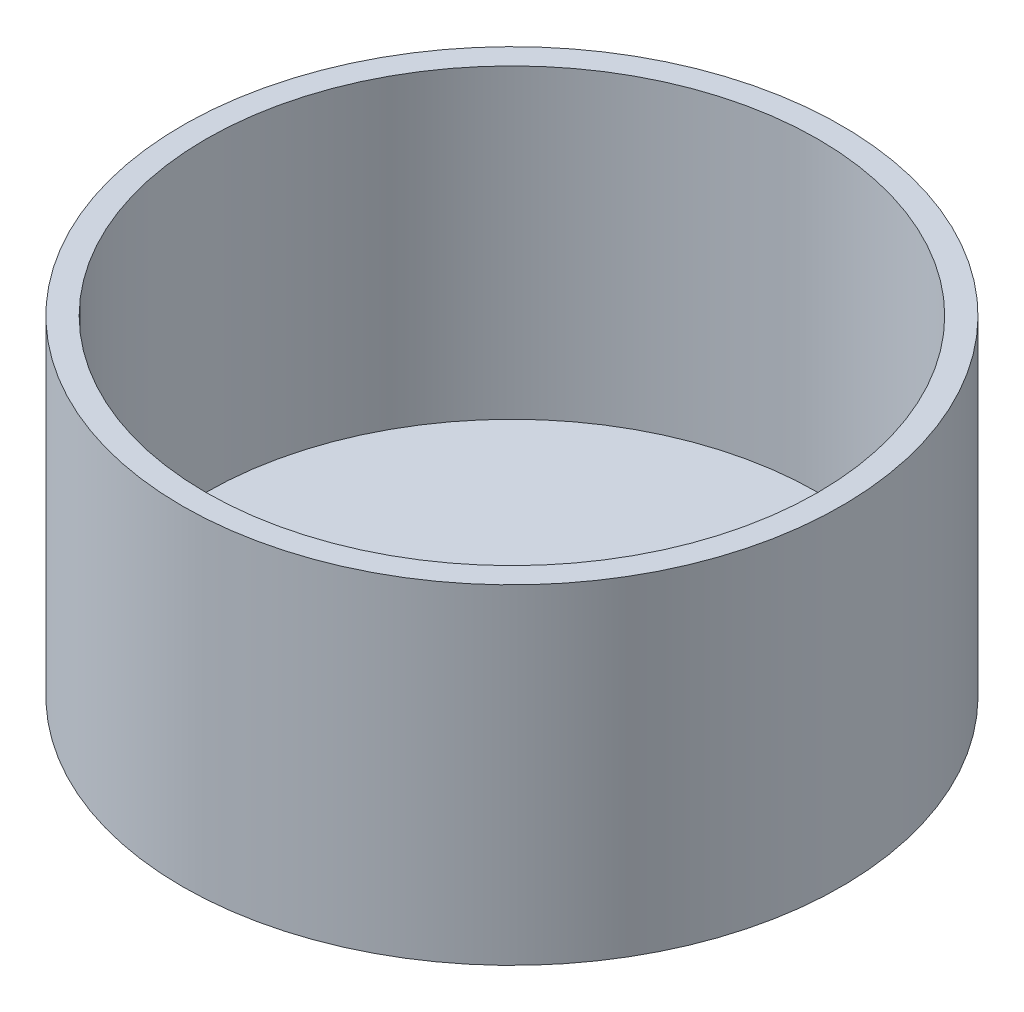
ISO-10303-21;
HEADER;
FILE_DESCRIPTION(('STEP AP214'),'2;1');
FILE_NAME('part.step','',(''),(''),'','','');
FILE_SCHEMA(('AUTOMOTIVE_DESIGN { 1 0 10303 214 1 1 1 1 }'));
ENDSEC;
DATA;
#1=APPLICATION_CONTEXT('core data for automotive mechanical design processes');
#2=APPLICATION_PROTOCOL_DEFINITION('international standard','automotive_design',2000,#1);
#3=PRODUCT_CONTEXT('',#1,'mechanical');
#4=PRODUCT('Part','Part','',(#3));
#5=PRODUCT_RELATED_PRODUCT_CATEGORY('part','',(#4));
#6=PRODUCT_DEFINITION_FORMATION('','',#4);
#7=PRODUCT_DEFINITION_CONTEXT('part definition',#1,'design');
#8=PRODUCT_DEFINITION('design','',#6,#7);
#9=PRODUCT_DEFINITION_SHAPE('','',#8);
#10=(LENGTH_UNIT() NAMED_UNIT(*) SI_UNIT(.MILLI.,.METRE.));
#11=(NAMED_UNIT(*) PLANE_ANGLE_UNIT() SI_UNIT($,.RADIAN.));
#12=(NAMED_UNIT(*) SI_UNIT($,.STERADIAN.) SOLID_ANGLE_UNIT());
#13=UNCERTAINTY_MEASURE_WITH_UNIT(LENGTH_MEASURE(1.E-05),#10,'distance_accuracy_value','');
#14=(GEOMETRIC_REPRESENTATION_CONTEXT(3) GLOBAL_UNCERTAINTY_ASSIGNED_CONTEXT((#13)) GLOBAL_UNIT_ASSIGNED_CONTEXT((#10,
#11,#12)) REPRESENTATION_CONTEXT('',''));
#15=CARTESIAN_POINT('',(0.,0.,0.));
#16=DIRECTION('',(0.,0.,1.));
#17=DIRECTION('',(1.,0.,0.));
#18=AXIS2_PLACEMENT_3D('',#15,#16,#17);
#19=CARTESIAN_POINT('',(0.,70.,0.));
#20=DIRECTION('',(0.,-1.,0.));
#21=DIRECTION('',(0.,0.,-1.));
#22=AXIS2_PLACEMENT_3D('',#19,#20,#21);
#23=CYLINDRICAL_SURFACE('',#22,70.);
#24=CARTESIAN_POINT('',(0.,70.,0.));
#25=DIRECTION('',(0.,1.,0.));
#26=DIRECTION('',(0.,0.,1.));
#27=AXIS2_PLACEMENT_3D('',#24,#25,#26);
#28=CIRCLE('',#27,70.);
#29=CARTESIAN_POINT('',(0.,70.,70.));
#30=VERTEX_POINT('',#29);
#31=EDGE_CURVE('E10',#30,#30,#28,.T.);
#32=ORIENTED_EDGE('',*,*,#31,.F.);
#33=EDGE_LOOP('',(#32));
#34=FACE_BOUND('',#33,.T.);
#35=CARTESIAN_POINT('',(0.,0.,0.));
#36=DIRECTION('',(0.,1.,0.));
#37=DIRECTION('',(0.,0.,1.));
#38=AXIS2_PLACEMENT_3D('',#35,#36,#37);
#39=CIRCLE('',#38,70.);
#40=CARTESIAN_POINT('',(0.,0.,70.));
#41=VERTEX_POINT('',#40);
#42=EDGE_CURVE('E36',#41,#41,#39,.T.);
#43=ORIENTED_EDGE('',*,*,#42,.T.);
#44=EDGE_LOOP('',(#43));
#45=FACE_BOUND('',#44,.T.);
#46=ADVANCED_FACE('F33',(#34,#45),#23,.T.);
#47=CARTESIAN_POINT('',(0.,70.,0.));
#48=DIRECTION('',(0.,1.,0.));
#49=DIRECTION('',(0.,0.,1.));
#50=AXIS2_PLACEMENT_3D('',#47,#48,#49);
#51=PLANE('',#50);
#52=CARTESIAN_POINT('',(0.,70.,0.));
#53=DIRECTION('',(0.,1.,0.));
#54=DIRECTION('',(0.,0.,1.));
#55=AXIS2_PLACEMENT_3D('',#52,#53,#54);
#56=CIRCLE('',#55,65.);
#57=CARTESIAN_POINT('',(0.,70.,65.));
#58=VERTEX_POINT('',#57);
#59=EDGE_CURVE('E43',#58,#58,#56,.T.);
#60=ORIENTED_EDGE('',*,*,#59,.F.);
#61=EDGE_LOOP('',(#60));
#62=FACE_BOUND('',#61,.T.);
#63=ORIENTED_EDGE('',*,*,#31,.T.);
#64=EDGE_LOOP('',(#63));
#65=FACE_BOUND('',#64,.T.);
#66=ADVANCED_FACE('F63',(#62,#65),#51,.T.);
#67=CARTESIAN_POINT('',(0.,0.,0.));
#68=DIRECTION('',(0.,1.,0.));
#69=DIRECTION('',(0.,0.,1.));
#70=AXIS2_PLACEMENT_3D('',#67,#68,#69);
#71=PLANE('',#70);
#72=ORIENTED_EDGE('',*,*,#42,.F.);
#73=EDGE_LOOP('',(#72));
#74=FACE_BOUND('',#73,.T.);
#75=ADVANCED_FACE('F55',(#74),#71,.F.);
#76=CARTESIAN_POINT('',(0.,70.,0.));
#77=DIRECTION('',(0.,-1.,0.));
#78=DIRECTION('',(0.,0.,-1.));
#79=AXIS2_PLACEMENT_3D('',#76,#77,#78);
#80=CYLINDRICAL_SURFACE('',#79,65.);
#81=ORIENTED_EDGE('',*,*,#59,.T.);
#82=EDGE_LOOP('',(#81));
#83=FACE_BOUND('',#82,.T.);
#84=CARTESIAN_POINT('',(0.,5.,0.));
#85=DIRECTION('',(0.,1.,0.));
#86=DIRECTION('',(0.,0.,1.));
#87=AXIS2_PLACEMENT_3D('',#84,#85,#86);
#88=CIRCLE('',#87,65.);
#89=CARTESIAN_POINT('',(0.,5.,65.));
#90=VERTEX_POINT('',#89);
#91=EDGE_CURVE('E47',#90,#90,#88,.T.);
#92=ORIENTED_EDGE('',*,*,#91,.F.);
#93=EDGE_LOOP('',(#92));
#94=FACE_BOUND('',#93,.T.);
#95=ADVANCED_FACE('F53',(#83,#94),#80,.F.);
#96=CARTESIAN_POINT('',(0.,5.,0.));
#97=DIRECTION('',(0.,1.,0.));
#98=DIRECTION('',(0.,0.,1.));
#99=AXIS2_PLACEMENT_3D('',#96,#97,#98);
#100=PLANE('',#99);
#101=ORIENTED_EDGE('',*,*,#91,.T.);
#102=EDGE_LOOP('',(#101));
#103=FACE_BOUND('',#102,.T.);
#104=ADVANCED_FACE('F51',(#103),#100,.T.);
#105=CLOSED_SHELL('',(#46,#66,#75,#95,#104));
#106=MANIFOLD_SOLID_BREP('B2',#105);
#107=ADVANCED_BREP_SHAPE_REPRESENTATION('',(#18,#106),#14);
#108=SHAPE_DEFINITION_REPRESENTATION(#9,#107);
ENDSEC;
END-ISO-10303-21;
